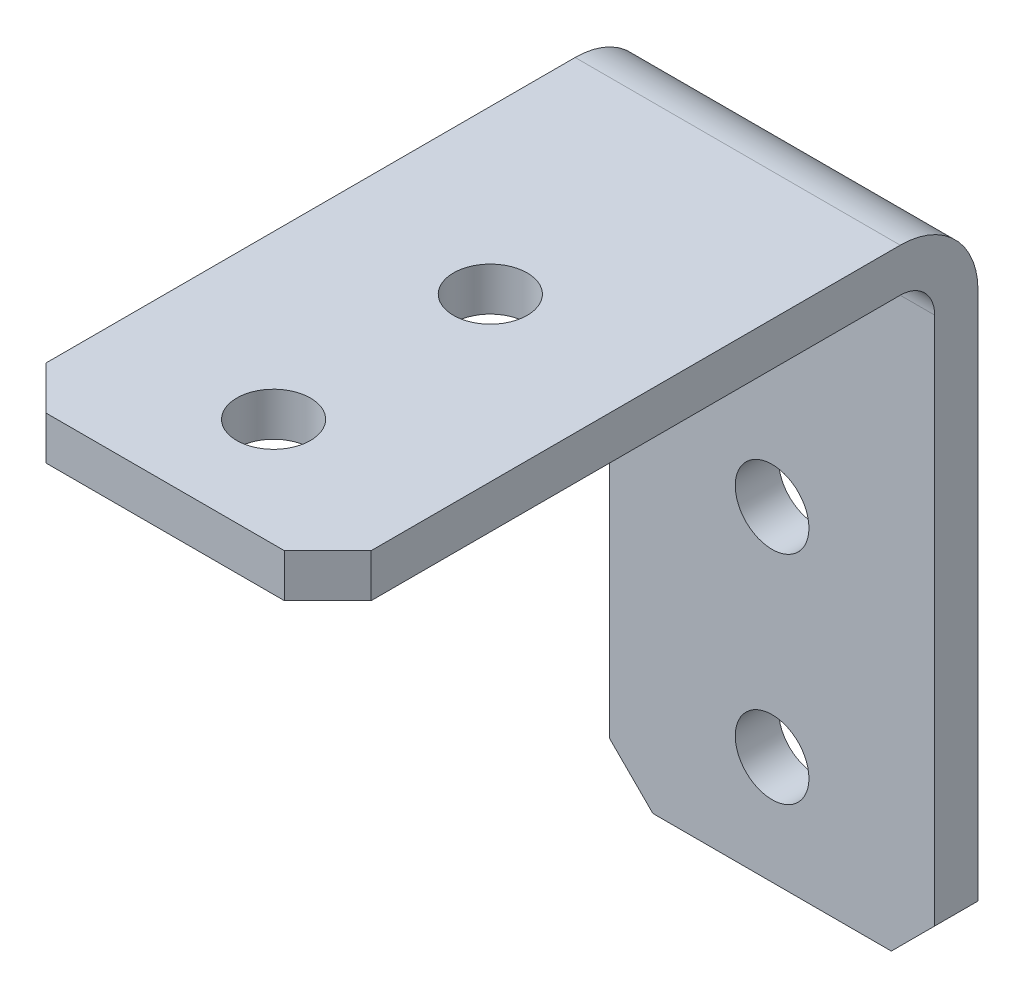
ISO-10303-21;
HEADER;
FILE_DESCRIPTION(('STEP AP214'),'2;1');
FILE_NAME('part.step','',(''),(''),'','','');
FILE_SCHEMA(('AUTOMOTIVE_DESIGN { 1 0 10303 214 1 1 1 1 }'));
ENDSEC;
DATA;
#1=APPLICATION_CONTEXT('core data for automotive mechanical design processes');
#2=APPLICATION_PROTOCOL_DEFINITION('international standard','automotive_design',2000,#1);
#3=PRODUCT_CONTEXT('',#1,'mechanical');
#4=PRODUCT('Part','Part','',(#3));
#5=PRODUCT_RELATED_PRODUCT_CATEGORY('part','',(#4));
#6=PRODUCT_DEFINITION_FORMATION('','',#4);
#7=PRODUCT_DEFINITION_CONTEXT('part definition',#1,'design');
#8=PRODUCT_DEFINITION('design','',#6,#7);
#9=PRODUCT_DEFINITION_SHAPE('','',#8);
#10=(LENGTH_UNIT() NAMED_UNIT(*) SI_UNIT(.MILLI.,.METRE.));
#11=(NAMED_UNIT(*) PLANE_ANGLE_UNIT() SI_UNIT($,.RADIAN.));
#12=(NAMED_UNIT(*) SI_UNIT($,.STERADIAN.) SOLID_ANGLE_UNIT());
#13=UNCERTAINTY_MEASURE_WITH_UNIT(LENGTH_MEASURE(1.E-05),#10,'distance_accuracy_value','');
#14=(GEOMETRIC_REPRESENTATION_CONTEXT(3) GLOBAL_UNCERTAINTY_ASSIGNED_CONTEXT((#13)) GLOBAL_UNIT_ASSIGNED_CONTEXT((#10,
#11,#12)) REPRESENTATION_CONTEXT('',''));
#15=CARTESIAN_POINT('',(0.,0.,0.));
#16=DIRECTION('',(0.,0.,1.));
#17=DIRECTION('',(1.,0.,0.));
#18=AXIS2_PLACEMENT_3D('',#15,#16,#17);
#19=CARTESIAN_POINT('',(0.,13.,0.));
#20=DIRECTION('',(0.,-1.,0.));
#21=DIRECTION('',(0.,0.,-1.));
#22=AXIS2_PLACEMENT_3D('',#19,#20,#21);
#23=PLANE('',#22);
#24=DIRECTION('',(0.,0.,1.));
#25=VECTOR('',#24,1.);
#26=CARTESIAN_POINT('',(7.5,13.,0.));
#27=LINE('',#26,#25);
#28=CARTESIAN_POINT('',(7.5,13.,1.58749999999999));
#29=VERTEX_POINT('',#28);
#30=CARTESIAN_POINT('',(7.5,13.,26.));
#31=VERTEX_POINT('',#30);
#32=EDGE_CURVE('E122',#29,#31,#27,.T.);
#33=ORIENTED_EDGE('',*,*,#32,.T.);
#34=DIRECTION('',(-0.707106781186549,0.,0.707106781186546));
#35=VECTOR('',#34,1.);
#36=CARTESIAN_POINT('',(7.5,13.0000000000001,26.));
#37=LINE('',#36,#35);
#38=CARTESIAN_POINT('',(5.5,13.0000000000001,28.));
#39=VERTEX_POINT('',#38);
#40=EDGE_CURVE('E147',#31,#39,#37,.T.);
#41=ORIENTED_EDGE('',*,*,#40,.T.);
#42=DIRECTION('',(1.,0.,0.));
#43=VECTOR('',#42,1.);
#44=CARTESIAN_POINT('',(7.5,13.0000000000001,28.));
#45=LINE('',#44,#43);
#46=CARTESIAN_POINT('',(-5.50000000000001,13.0000000000001,28.));
#47=VERTEX_POINT('',#46);
#48=EDGE_CURVE('E235',#39,#47,#45,.F.);
#49=ORIENTED_EDGE('',*,*,#48,.T.);
#50=DIRECTION('',(-0.707106781186545,0.,-0.70710678118655));
#51=VECTOR('',#50,1.);
#52=CARTESIAN_POINT('',(-5.50000000000001,13.0000000000001,28.));
#53=LINE('',#52,#51);
#54=CARTESIAN_POINT('',(-7.5,13.0000000000001,26.));
#55=VERTEX_POINT('',#54);
#56=EDGE_CURVE('E119',#47,#55,#53,.T.);
#57=ORIENTED_EDGE('',*,*,#56,.T.);
#58=DIRECTION('',(0.,0.,-1.));
#59=VECTOR('',#58,1.);
#60=CARTESIAN_POINT('',(-7.5,13.0000000000001,28.));
#61=LINE('',#60,#59);
#62=CARTESIAN_POINT('',(-7.5,13.0000000000001,1.58749999999999));
#63=VERTEX_POINT('',#62);
#64=EDGE_CURVE('E116',#55,#63,#61,.T.);
#65=ORIENTED_EDGE('',*,*,#64,.T.);
#66=DIRECTION('',(-1.,0.,0.));
#67=VECTOR('',#66,1.);
#68=CARTESIAN_POINT('',(-7.5,13.,1.58749999999999));
#69=LINE('',#68,#67);
#70=EDGE_CURVE('E103',#63,#29,#69,.F.);
#71=ORIENTED_EDGE('',*,*,#70,.T.);
#72=EDGE_LOOP('',(#33,#41,#49,#57,#65,#71));
#73=FACE_BOUND('',#72,.T.);
#74=CARTESIAN_POINT('',(0.,13.0000000000001,23.));
#75=DIRECTION('',(0.,-1.,0.));
#76=DIRECTION('',(0.,0.,-1.));
#77=AXIS2_PLACEMENT_3D('',#74,#75,#76);
#78=CIRCLE('',#77,1.7);
#79=CARTESIAN_POINT('',(0.,13.0000000000001,21.3));
#80=VERTEX_POINT('',#79);
#81=EDGE_CURVE('E145',#80,#80,#78,.F.);
#82=ORIENTED_EDGE('',*,*,#81,.T.);
#83=EDGE_LOOP('',(#82));
#84=FACE_BOUND('',#83,.T.);
#85=CARTESIAN_POINT('',(0.,13.,13.));
#86=DIRECTION('',(0.,-1.,0.));
#87=DIRECTION('',(0.,0.,-1.));
#88=AXIS2_PLACEMENT_3D('',#85,#86,#87);
#89=CIRCLE('',#88,1.7);
#90=CARTESIAN_POINT('',(0.,13.,11.3));
#91=VERTEX_POINT('',#90);
#92=EDGE_CURVE('E20',#91,#91,#89,.F.);
#93=ORIENTED_EDGE('',*,*,#92,.T.);
#94=EDGE_LOOP('',(#93));
#95=FACE_BOUND('',#94,.T.);
#96=ADVANCED_FACE('F17',(#73,#84,#95),#23,.T.);
#97=CARTESIAN_POINT('',(0.,23.0000000000001,13.));
#98=DIRECTION('',(0.,-1.,0.));
#99=DIRECTION('',(0.,0.,-1.));
#100=AXIS2_PLACEMENT_3D('',#97,#98,#99);
#101=CYLINDRICAL_SURFACE('',#100,1.7);
#102=CARTESIAN_POINT('',(0.,15.,13.));
#103=DIRECTION('',(0.,-1.,0.));
#104=DIRECTION('',(0.,0.,-1.));
#105=AXIS2_PLACEMENT_3D('',#102,#103,#104);
#106=CIRCLE('',#105,1.7);
#107=CARTESIAN_POINT('',(0.,15.,11.3));
#108=VERTEX_POINT('',#107);
#109=EDGE_CURVE('E112',#108,#108,#106,.F.);
#110=ORIENTED_EDGE('',*,*,#109,.T.);
#111=EDGE_LOOP('',(#110));
#112=FACE_BOUND('',#111,.T.);
#113=ORIENTED_EDGE('',*,*,#92,.F.);
#114=EDGE_LOOP('',(#113));
#115=FACE_BOUND('',#114,.T.);
#116=ADVANCED_FACE('F155',(#112,#115),#101,.F.);
#117=CARTESIAN_POINT('',(0.,23.0000000000001,23.));
#118=DIRECTION('',(0.,-1.,0.));
#119=DIRECTION('',(0.,0.,-1.));
#120=AXIS2_PLACEMENT_3D('',#117,#118,#119);
#121=CYLINDRICAL_SURFACE('',#120,1.7);
#122=CARTESIAN_POINT('',(0.,15.0000000000001,23.));
#123=DIRECTION('',(0.,-1.,0.));
#124=DIRECTION('',(0.,0.,-1.));
#125=AXIS2_PLACEMENT_3D('',#122,#123,#124);
#126=CIRCLE('',#125,1.7);
#127=CARTESIAN_POINT('',(0.,15.0000000000001,21.3));
#128=VERTEX_POINT('',#127);
#129=EDGE_CURVE('E140',#128,#128,#126,.F.);
#130=ORIENTED_EDGE('',*,*,#129,.T.);
#131=EDGE_LOOP('',(#130));
#132=FACE_BOUND('',#131,.T.);
#133=ORIENTED_EDGE('',*,*,#81,.F.);
#134=EDGE_LOOP('',(#133));
#135=FACE_BOUND('',#134,.T.);
#136=ADVANCED_FACE('F157',(#132,#135),#121,.F.);
#137=CARTESIAN_POINT('',(7.5,15.0000000000001,26.));
#138=DIRECTION('',(-0.707106781186546,0.,-0.707106781186549));
#139=DIRECTION('',(-0.707106781186549,0.,0.707106781186546));
#140=AXIS2_PLACEMENT_3D('',#137,#138,#139);
#141=PLANE('',#140);
#142=DIRECTION('',(0.,1.,0.));
#143=VECTOR('',#142,1.);
#144=CARTESIAN_POINT('',(5.5,15.0000000000001,28.));
#145=LINE('',#144,#143);
#146=CARTESIAN_POINT('',(5.5,15.0000000000001,28.));
#147=VERTEX_POINT('',#146);
#148=EDGE_CURVE('E149',#147,#39,#145,.F.);
#149=ORIENTED_EDGE('',*,*,#148,.T.);
#150=ORIENTED_EDGE('',*,*,#40,.F.);
#151=DIRECTION('',(0.,1.,0.));
#152=VECTOR('',#151,1.);
#153=CARTESIAN_POINT('',(7.5,15.,26.));
#154=LINE('',#153,#152);
#155=CARTESIAN_POINT('',(7.5,15.0000000000001,26.));
#156=VERTEX_POINT('',#155);
#157=EDGE_CURVE('E113',#31,#156,#154,.T.);
#158=ORIENTED_EDGE('',*,*,#157,.T.);
#159=DIRECTION('',(-0.707106781186549,0.,0.707106781186546));
#160=VECTOR('',#159,1.);
#161=CARTESIAN_POINT('',(7.5,15.0000000000001,26.));
#162=LINE('',#161,#160);
#163=EDGE_CURVE('E231',#156,#147,#162,.T.);
#164=ORIENTED_EDGE('',*,*,#163,.T.);
#165=EDGE_LOOP('',(#149,#150,#158,#164));
#166=FACE_BOUND('',#165,.T.);
#167=ADVANCED_FACE('F164',(#166),#141,.F.);
#168=CARTESIAN_POINT('',(7.5,15.0000000000001,28.));
#169=DIRECTION('',(0.,0.,-1.));
#170=DIRECTION('',(0.,1.,0.));
#171=AXIS2_PLACEMENT_3D('',#168,#169,#170);
#172=PLANE('',#171);
#173=DIRECTION('',(0.,1.,0.));
#174=VECTOR('',#173,1.);
#175=CARTESIAN_POINT('',(-5.50000000000001,15.0000000000001,28.));
#176=LINE('',#175,#174);
#177=CARTESIAN_POINT('',(-5.50000000000001,15.0000000000001,28.));
#178=VERTEX_POINT('',#177);
#179=EDGE_CURVE('E237',#178,#47,#176,.F.);
#180=ORIENTED_EDGE('',*,*,#179,.T.);
#181=ORIENTED_EDGE('',*,*,#48,.F.);
#182=ORIENTED_EDGE('',*,*,#148,.F.);
#183=DIRECTION('',(1.,0.,0.));
#184=VECTOR('',#183,1.);
#185=CARTESIAN_POINT('',(0.,15.0000000000001,28.));
#186=LINE('',#185,#184);
#187=EDGE_CURVE('E246',#147,#178,#186,.F.);
#188=ORIENTED_EDGE('',*,*,#187,.T.);
#189=EDGE_LOOP('',(#180,#181,#182,#188));
#190=FACE_BOUND('',#189,.T.);
#191=ADVANCED_FACE('F218',(#190),#172,.F.);
#192=CARTESIAN_POINT('',(-5.50000000000001,15.0000000000001,28.));
#193=DIRECTION('',(0.70710678118655,0.,-0.707106781186545));
#194=DIRECTION('',(-0.707106781186545,0.,-0.70710678118655));
#195=AXIS2_PLACEMENT_3D('',#192,#193,#194);
#196=PLANE('',#195);
#197=DIRECTION('',(0.,1.,0.));
#198=VECTOR('',#197,1.);
#199=CARTESIAN_POINT('',(-7.5,15.0000000000001,26.));
#200=LINE('',#199,#198);
#201=CARTESIAN_POINT('',(-7.5,15.0000000000001,26.));
#202=VERTEX_POINT('',#201);
#203=EDGE_CURVE('E123',#202,#55,#200,.F.);
#204=ORIENTED_EDGE('',*,*,#203,.T.);
#205=ORIENTED_EDGE('',*,*,#56,.F.);
#206=ORIENTED_EDGE('',*,*,#179,.F.);
#207=DIRECTION('',(-0.707106781186545,0.,-0.70710678118655));
#208=VECTOR('',#207,1.);
#209=CARTESIAN_POINT('',(-5.50000000000001,15.0000000000001,28.));
#210=LINE('',#209,#208);
#211=EDGE_CURVE('E135',#178,#202,#210,.T.);
#212=ORIENTED_EDGE('',*,*,#211,.T.);
#213=EDGE_LOOP('',(#204,#205,#206,#212));
#214=FACE_BOUND('',#213,.T.);
#215=ADVANCED_FACE('F215',(#214),#196,.F.);
#216=CARTESIAN_POINT('',(-7.5,11.4125,1.5875));
#217=DIRECTION('',(-1.,0.,0.));
#218=DIRECTION('',(0.,0.,1.));
#219=AXIS2_PLACEMENT_3D('',#216,#217,#218);
#220=CYLINDRICAL_SURFACE('',#219,1.5875);
#221=CARTESIAN_POINT('',(7.5,11.4125,1.5875));
#222=DIRECTION('',(-1.,0.,0.));
#223=DIRECTION('',(0.,0.,1.));
#224=AXIS2_PLACEMENT_3D('',#221,#222,#223);
#225=CIRCLE('',#224,1.5875);
#226=CARTESIAN_POINT('',(7.5,11.4125,0.));
#227=VERTEX_POINT('',#226);
#228=EDGE_CURVE('E109',#29,#227,#225,.T.);
#229=ORIENTED_EDGE('',*,*,#228,.F.);
#230=ORIENTED_EDGE('',*,*,#70,.F.);
#231=CARTESIAN_POINT('',(-7.5,11.4125,1.5875));
#232=DIRECTION('',(-1.,0.,0.));
#233=DIRECTION('',(0.,0.,1.));
#234=AXIS2_PLACEMENT_3D('',#231,#232,#233);
#235=CIRCLE('',#234,1.5875);
#236=CARTESIAN_POINT('',(-7.5,11.4125,0.));
#237=VERTEX_POINT('',#236);
#238=EDGE_CURVE('E108',#63,#237,#235,.T.);
#239=ORIENTED_EDGE('',*,*,#238,.T.);
#240=DIRECTION('',(1.,0.,0.));
#241=VECTOR('',#240,1.);
#242=CARTESIAN_POINT('',(0.,11.4125,0.));
#243=LINE('',#242,#241);
#244=EDGE_CURVE('E129',#227,#237,#243,.F.);
#245=ORIENTED_EDGE('',*,*,#244,.F.);
#246=EDGE_LOOP('',(#229,#230,#239,#245));
#247=FACE_BOUND('',#246,.T.);
#248=ADVANCED_FACE('F105',(#247),#220,.F.);
#249=CARTESIAN_POINT('',(0.,15.,0.));
#250=DIRECTION('',(0.,-1.,0.));
#251=DIRECTION('',(0.,0.,-1.));
#252=AXIS2_PLACEMENT_3D('',#249,#250,#251);
#253=PLANE('',#252);
#254=ORIENTED_EDGE('',*,*,#211,.F.);
#255=ORIENTED_EDGE('',*,*,#187,.F.);
#256=ORIENTED_EDGE('',*,*,#163,.F.);
#257=DIRECTION('',(0.,0.,-1.));
#258=VECTOR('',#257,1.);
#259=CARTESIAN_POINT('',(7.5,15.,0.));
#260=LINE('',#259,#258);
#261=CARTESIAN_POINT('',(7.5,15.,1.58749999999999));
#262=VERTEX_POINT('',#261);
#263=EDGE_CURVE('E143',#262,#156,#260,.F.);
#264=ORIENTED_EDGE('',*,*,#263,.F.);
#265=DIRECTION('',(-1.,0.,0.));
#266=VECTOR('',#265,1.);
#267=CARTESIAN_POINT('',(-7.5,15.,1.58749999999999));
#268=LINE('',#267,#266);
#269=CARTESIAN_POINT('',(-7.5,15.,1.58749999999999));
#270=VERTEX_POINT('',#269);
#271=EDGE_CURVE('E268',#270,#262,#268,.F.);
#272=ORIENTED_EDGE('',*,*,#271,.F.);
#273=DIRECTION('',(0.,0.,-1.));
#274=VECTOR('',#273,1.);
#275=CARTESIAN_POINT('',(-7.5,15.,0.));
#276=LINE('',#275,#274);
#277=EDGE_CURVE('E130',#202,#270,#276,.T.);
#278=ORIENTED_EDGE('',*,*,#277,.F.);
#279=EDGE_LOOP('',(#254,#255,#256,#264,#272,#278));
#280=FACE_BOUND('',#279,.T.);
#281=ORIENTED_EDGE('',*,*,#129,.F.);
#282=EDGE_LOOP('',(#281));
#283=FACE_BOUND('',#282,.T.);
#284=ORIENTED_EDGE('',*,*,#109,.F.);
#285=EDGE_LOOP('',(#284));
#286=FACE_BOUND('',#285,.T.);
#287=ADVANCED_FACE('F208',(#280,#283,#286),#253,.F.);
#288=CARTESIAN_POINT('',(0.,0.,0.));
#289=DIRECTION('',(0.,0.,1.));
#290=DIRECTION('',(1.,0.,0.));
#291=AXIS2_PLACEMENT_3D('',#288,#289,#290);
#292=PLANE('',#291);
#293=DIRECTION('',(0.,-1.,0.));
#294=VECTOR('',#293,1.);
#295=CARTESIAN_POINT('',(-7.5,15.,0.));
#296=LINE('',#295,#294);
#297=CARTESIAN_POINT('',(-7.5,-13.,0.));
#298=VERTEX_POINT('',#297);
#299=EDGE_CURVE('E128',#298,#237,#296,.F.);
#300=ORIENTED_EDGE('',*,*,#299,.F.);
#301=DIRECTION('',(-0.707106781186549,0.707106781186546,0.));
#302=VECTOR('',#301,1.);
#303=CARTESIAN_POINT('',(-7.5,-13.,0.));
#304=LINE('',#303,#302);
#305=CARTESIAN_POINT('',(-5.5,-15.,0.));
#306=VERTEX_POINT('',#305);
#307=EDGE_CURVE('E302',#298,#306,#304,.F.);
#308=ORIENTED_EDGE('',*,*,#307,.T.);
#309=DIRECTION('',(1.,0.,0.));
#310=VECTOR('',#309,1.);
#311=CARTESIAN_POINT('',(-7.5,-15.,0.));
#312=LINE('',#311,#310);
#313=CARTESIAN_POINT('',(5.5,-15.,0.));
#314=VERTEX_POINT('',#313);
#315=EDGE_CURVE('E300',#314,#306,#312,.F.);
#316=ORIENTED_EDGE('',*,*,#315,.F.);
#317=DIRECTION('',(-0.707106781186547,-0.707106781186548,0.));
#318=VECTOR('',#317,1.);
#319=CARTESIAN_POINT('',(5.5,-15.,0.));
#320=LINE('',#319,#318);
#321=CARTESIAN_POINT('',(7.5,-13.,0.));
#322=VERTEX_POINT('',#321);
#323=EDGE_CURVE('E282',#314,#322,#320,.F.);
#324=ORIENTED_EDGE('',*,*,#323,.T.);
#325=DIRECTION('',(0.,1.,0.));
#326=VECTOR('',#325,1.);
#327=CARTESIAN_POINT('',(7.5,15.,0.));
#328=LINE('',#327,#326);
#329=EDGE_CURVE('E278',#227,#322,#328,.F.);
#330=ORIENTED_EDGE('',*,*,#329,.F.);
#331=ORIENTED_EDGE('',*,*,#244,.T.);
#332=EDGE_LOOP('',(#300,#308,#316,#324,#330,#331));
#333=FACE_BOUND('',#332,.T.);
#334=CARTESIAN_POINT('',(0.,-9.99999999999999,0.));
#335=DIRECTION('',(0.,0.,1.));
#336=DIRECTION('',(1.,0.,0.));
#337=AXIS2_PLACEMENT_3D('',#334,#335,#336);
#338=CIRCLE('',#337,1.7);
#339=CARTESIAN_POINT('',(1.7,-9.99999999999999,0.));
#340=VERTEX_POINT('',#339);
#341=EDGE_CURVE('E271',#340,#340,#338,.F.);
#342=ORIENTED_EDGE('',*,*,#341,.T.);
#343=EDGE_LOOP('',(#342));
#344=FACE_BOUND('',#343,.T.);
#345=CARTESIAN_POINT('',(0.,0.,0.));
#346=DIRECTION('',(0.,0.,1.));
#347=DIRECTION('',(1.,0.,0.));
#348=AXIS2_PLACEMENT_3D('',#345,#346,#347);
#349=CIRCLE('',#348,1.7);
#350=CARTESIAN_POINT('',(1.7,0.,0.));
#351=VERTEX_POINT('',#350);
#352=EDGE_CURVE('E273',#351,#351,#349,.F.);
#353=ORIENTED_EDGE('',*,*,#352,.T.);
#354=EDGE_LOOP('',(#353));
#355=FACE_BOUND('',#354,.T.);
#356=ADVANCED_FACE('F204',(#333,#344,#355),#292,.T.);
#357=CARTESIAN_POINT('',(0.,0.,-10.));
#358=DIRECTION('',(0.,0.,1.));
#359=DIRECTION('',(1.,0.,0.));
#360=AXIS2_PLACEMENT_3D('',#357,#358,#359);
#361=CYLINDRICAL_SURFACE('',#360,1.7);
#362=CARTESIAN_POINT('',(0.,0.,-2.));
#363=DIRECTION('',(0.,0.,1.));
#364=DIRECTION('',(1.,0.,0.));
#365=AXIS2_PLACEMENT_3D('',#362,#363,#364);
#366=CIRCLE('',#365,1.7);
#367=CARTESIAN_POINT('',(1.7,0.,-2.));
#368=VERTEX_POINT('',#367);
#369=EDGE_CURVE('E263',#368,#368,#366,.F.);
#370=ORIENTED_EDGE('',*,*,#369,.T.);
#371=EDGE_LOOP('',(#370));
#372=FACE_BOUND('',#371,.T.);
#373=ORIENTED_EDGE('',*,*,#352,.F.);
#374=EDGE_LOOP('',(#373));
#375=FACE_BOUND('',#374,.T.);
#376=ADVANCED_FACE('F200',(#372,#375),#361,.F.);
#377=CARTESIAN_POINT('',(0.,-9.99999999999999,-10.));
#378=DIRECTION('',(0.,0.,1.));
#379=DIRECTION('',(1.,0.,0.));
#380=AXIS2_PLACEMENT_3D('',#377,#378,#379);
#381=CYLINDRICAL_SURFACE('',#380,1.7);
#382=CARTESIAN_POINT('',(0.,-9.99999999999999,-2.));
#383=DIRECTION('',(0.,0.,1.));
#384=DIRECTION('',(1.,0.,0.));
#385=AXIS2_PLACEMENT_3D('',#382,#383,#384);
#386=CIRCLE('',#385,1.7);
#387=CARTESIAN_POINT('',(1.7,-9.99999999999999,-2.));
#388=VERTEX_POINT('',#387);
#389=EDGE_CURVE('E259',#388,#388,#386,.F.);
#390=ORIENTED_EDGE('',*,*,#389,.T.);
#391=EDGE_LOOP('',(#390));
#392=FACE_BOUND('',#391,.T.);
#393=ORIENTED_EDGE('',*,*,#341,.F.);
#394=EDGE_LOOP('',(#393));
#395=FACE_BOUND('',#394,.T.);
#396=ADVANCED_FACE('F196',(#392,#395),#381,.F.);
#397=CARTESIAN_POINT('',(-7.5,11.4125,1.5875));
#398=DIRECTION('',(-1.,0.,0.));
#399=DIRECTION('',(0.,0.,1.));
#400=AXIS2_PLACEMENT_3D('',#397,#398,#399);
#401=CYLINDRICAL_SURFACE('',#400,3.5875);
#402=ORIENTED_EDGE('',*,*,#271,.T.);
#403=CARTESIAN_POINT('',(7.5,11.4125,1.5875));
#404=DIRECTION('',(-1.,0.,0.));
#405=DIRECTION('',(0.,0.,1.));
#406=AXIS2_PLACEMENT_3D('',#403,#404,#405);
#407=CIRCLE('',#406,3.5875);
#408=CARTESIAN_POINT('',(7.5,11.4125,-2.));
#409=VERTEX_POINT('',#408);
#410=EDGE_CURVE('E266',#262,#409,#407,.T.);
#411=ORIENTED_EDGE('',*,*,#410,.T.);
#412=DIRECTION('',(1.,0.,0.));
#413=VECTOR('',#412,1.);
#414=CARTESIAN_POINT('',(0.,11.4125,-2.));
#415=LINE('',#414,#413);
#416=CARTESIAN_POINT('',(-7.5,11.4125,-2.));
#417=VERTEX_POINT('',#416);
#418=EDGE_CURVE('E262',#409,#417,#415,.F.);
#419=ORIENTED_EDGE('',*,*,#418,.T.);
#420=CARTESIAN_POINT('',(-7.5,11.4125,1.5875));
#421=DIRECTION('',(-1.,0.,0.));
#422=DIRECTION('',(0.,0.,1.));
#423=AXIS2_PLACEMENT_3D('',#420,#421,#422);
#424=CIRCLE('',#423,3.5875);
#425=EDGE_CURVE('E269',#417,#270,#424,.F.);
#426=ORIENTED_EDGE('',*,*,#425,.T.);
#427=EDGE_LOOP('',(#402,#411,#419,#426));
#428=FACE_BOUND('',#427,.T.);
#429=ADVANCED_FACE('F193',(#428),#401,.T.);
#430=CARTESIAN_POINT('',(-7.5,15.,-2.));
#431=DIRECTION('',(-1.,0.,0.));
#432=DIRECTION('',(0.,-1.,0.));
#433=AXIS2_PLACEMENT_3D('',#430,#431,#432);
#434=PLANE('',#433);
#435=ORIENTED_EDGE('',*,*,#299,.T.);
#436=ORIENTED_EDGE('',*,*,#238,.F.);
#437=ORIENTED_EDGE('',*,*,#64,.F.);
#438=ORIENTED_EDGE('',*,*,#203,.F.);
#439=ORIENTED_EDGE('',*,*,#277,.T.);
#440=ORIENTED_EDGE('',*,*,#425,.F.);
#441=DIRECTION('',(0.,1.,0.));
#442=VECTOR('',#441,1.);
#443=CARTESIAN_POINT('',(-7.5,0.,-2.));
#444=LINE('',#443,#442);
#445=CARTESIAN_POINT('',(-7.5,-13.,-2.));
#446=VERTEX_POINT('',#445);
#447=EDGE_CURVE('E331',#417,#446,#444,.F.);
#448=ORIENTED_EDGE('',*,*,#447,.T.);
#449=DIRECTION('',(0.,0.,1.));
#450=VECTOR('',#449,1.);
#451=CARTESIAN_POINT('',(-7.5,-13.,-2.));
#452=LINE('',#451,#450);
#453=EDGE_CURVE('E317',#446,#298,#452,.T.);
#454=ORIENTED_EDGE('',*,*,#453,.T.);
#455=EDGE_LOOP('',(#435,#436,#437,#438,#439,#440,#448,#454));
#456=FACE_BOUND('',#455,.T.);
#457=ADVANCED_FACE('F126',(#456),#434,.T.);
#458=CARTESIAN_POINT('',(-7.5,-13.,-2.));
#459=DIRECTION('',(0.707106781186546,0.707106781186549,0.));
#460=DIRECTION('',(-0.707106781186549,0.707106781186546,0.));
#461=AXIS2_PLACEMENT_3D('',#458,#459,#460);
#462=PLANE('',#461);
#463=DIRECTION('',(0.,0.,-1.));
#464=VECTOR('',#463,1.);
#465=CARTESIAN_POINT('',(-5.5,-15.,-2.));
#466=LINE('',#465,#464);
#467=CARTESIAN_POINT('',(-5.5,-15.,-2.));
#468=VERTEX_POINT('',#467);
#469=EDGE_CURVE('E297',#306,#468,#466,.T.);
#470=ORIENTED_EDGE('',*,*,#469,.F.);
#471=ORIENTED_EDGE('',*,*,#307,.F.);
#472=ORIENTED_EDGE('',*,*,#453,.F.);
#473=DIRECTION('',(0.707106781186549,-0.707106781186546,0.));
#474=VECTOR('',#473,1.);
#475=CARTESIAN_POINT('',(-7.5,-13.,-2.));
#476=LINE('',#475,#474);
#477=EDGE_CURVE('E312',#446,#468,#476,.T.);
#478=ORIENTED_EDGE('',*,*,#477,.T.);
#479=EDGE_LOOP('',(#470,#471,#472,#478));
#480=FACE_BOUND('',#479,.T.);
#481=ADVANCED_FACE('F186',(#480),#462,.F.);
#482=CARTESIAN_POINT('',(-7.5,-15.,-2.));
#483=DIRECTION('',(0.,-1.,0.));
#484=DIRECTION('',(0.,0.,-1.));
#485=AXIS2_PLACEMENT_3D('',#482,#483,#484);
#486=PLANE('',#485);
#487=ORIENTED_EDGE('',*,*,#315,.T.);
#488=ORIENTED_EDGE('',*,*,#469,.T.);
#489=DIRECTION('',(1.,0.,0.));
#490=VECTOR('',#489,1.);
#491=CARTESIAN_POINT('',(0.,-15.,-2.));
#492=LINE('',#491,#490);
#493=CARTESIAN_POINT('',(5.5,-15.,-2.));
#494=VERTEX_POINT('',#493);
#495=EDGE_CURVE('E307',#468,#494,#492,.T.);
#496=ORIENTED_EDGE('',*,*,#495,.T.);
#497=DIRECTION('',(0.,0.,1.));
#498=VECTOR('',#497,1.);
#499=CARTESIAN_POINT('',(5.5,-15.,-2.));
#500=LINE('',#499,#498);
#501=EDGE_CURVE('E285',#494,#314,#500,.T.);
#502=ORIENTED_EDGE('',*,*,#501,.T.);
#503=EDGE_LOOP('',(#487,#488,#496,#502));
#504=FACE_BOUND('',#503,.T.);
#505=ADVANCED_FACE('F182',(#504),#486,.T.);
#506=CARTESIAN_POINT('',(5.5,-15.,-2.));
#507=DIRECTION('',(-0.707106781186548,0.707106781186547,0.));
#508=DIRECTION('',(-0.707106781186547,-0.707106781186548,0.));
#509=AXIS2_PLACEMENT_3D('',#506,#507,#508);
#510=PLANE('',#509);
#511=DIRECTION('',(0.,0.,1.));
#512=VECTOR('',#511,1.);
#513=CARTESIAN_POINT('',(7.5,-13.,-2.));
#514=LINE('',#513,#512);
#515=CARTESIAN_POINT('',(7.5,-13.,-2.));
#516=VERTEX_POINT('',#515);
#517=EDGE_CURVE('E34',#322,#516,#514,.F.);
#518=ORIENTED_EDGE('',*,*,#517,.F.);
#519=ORIENTED_EDGE('',*,*,#323,.F.);
#520=ORIENTED_EDGE('',*,*,#501,.F.);
#521=DIRECTION('',(0.707106781186546,0.707106781186549,0.));
#522=VECTOR('',#521,1.);
#523=CARTESIAN_POINT('',(5.49999999999999,-15.,-2.));
#524=LINE('',#523,#522);
#525=EDGE_CURVE('E26',#494,#516,#524,.T.);
#526=ORIENTED_EDGE('',*,*,#525,.T.);
#527=EDGE_LOOP('',(#518,#519,#520,#526));
#528=FACE_BOUND('',#527,.T.);
#529=ADVANCED_FACE('F175',(#528),#510,.F.);
#530=CARTESIAN_POINT('',(7.5,15.,-2.));
#531=DIRECTION('',(1.,0.,0.));
#532=DIRECTION('',(0.,1.,0.));
#533=AXIS2_PLACEMENT_3D('',#530,#531,#532);
#534=PLANE('',#533);
#535=DIRECTION('',(0.,1.,0.));
#536=VECTOR('',#535,1.);
#537=CARTESIAN_POINT('',(7.50000000000001,0.,-2.));
#538=LINE('',#537,#536);
#539=EDGE_CURVE('E10',#516,#409,#538,.T.);
#540=ORIENTED_EDGE('',*,*,#539,.T.);
#541=ORIENTED_EDGE('',*,*,#410,.F.);
#542=ORIENTED_EDGE('',*,*,#263,.T.);
#543=ORIENTED_EDGE('',*,*,#157,.F.);
#544=ORIENTED_EDGE('',*,*,#32,.F.);
#545=ORIENTED_EDGE('',*,*,#228,.T.);
#546=ORIENTED_EDGE('',*,*,#329,.T.);
#547=ORIENTED_EDGE('',*,*,#517,.T.);
#548=EDGE_LOOP('',(#540,#541,#542,#543,#544,#545,#546,#547));
#549=FACE_BOUND('',#548,.T.);
#550=ADVANCED_FACE('F169',(#549),#534,.T.);
#551=CARTESIAN_POINT('',(0.,0.,-2.));
#552=DIRECTION('',(0.,0.,1.));
#553=DIRECTION('',(1.,0.,0.));
#554=AXIS2_PLACEMENT_3D('',#551,#552,#553);
#555=PLANE('',#554);
#556=ORIENTED_EDGE('',*,*,#525,.F.);
#557=ORIENTED_EDGE('',*,*,#495,.F.);
#558=ORIENTED_EDGE('',*,*,#477,.F.);
#559=ORIENTED_EDGE('',*,*,#447,.F.);
#560=ORIENTED_EDGE('',*,*,#418,.F.);
#561=ORIENTED_EDGE('',*,*,#539,.F.);
#562=EDGE_LOOP('',(#556,#557,#558,#559,#560,#561));
#563=FACE_BOUND('',#562,.T.);
#564=ORIENTED_EDGE('',*,*,#389,.F.);
#565=EDGE_LOOP('',(#564));
#566=FACE_BOUND('',#565,.T.);
#567=ORIENTED_EDGE('',*,*,#369,.F.);
#568=EDGE_LOOP('',(#567));
#569=FACE_BOUND('',#568,.T.);
#570=ADVANCED_FACE('F167',(#563,#566,#569),#555,.F.);
#571=CLOSED_SHELL('',(#96,#116,#136,#167,#191,#215,#248,#287,#356,#376,#396,#429,#457,#481,#505,
#529,#550,#570));
#572=MANIFOLD_SOLID_BREP('B1',#571);
#573=ADVANCED_BREP_SHAPE_REPRESENTATION('',(#18,#572),#14);
#574=SHAPE_DEFINITION_REPRESENTATION(#9,#573);
ENDSEC;
END-ISO-10303-21;
